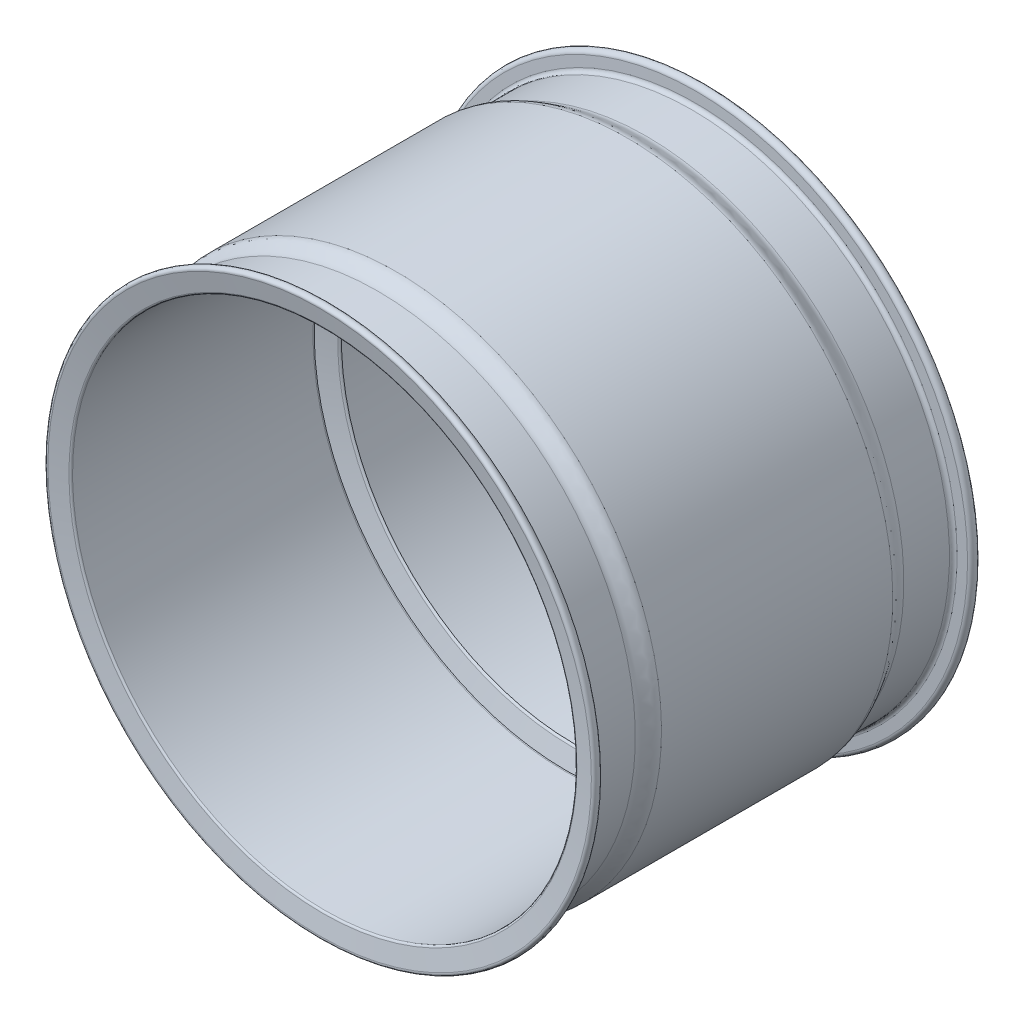
ISO-10303-21;
HEADER;
FILE_DESCRIPTION(('STEP AP214'),'2;1');
FILE_NAME('part.step','',(''),(''),'','','');
FILE_SCHEMA(('AUTOMOTIVE_DESIGN { 1 0 10303 214 1 1 1 1 }'));
ENDSEC;
DATA;
#1=APPLICATION_CONTEXT('core data for automotive mechanical design processes');
#2=APPLICATION_PROTOCOL_DEFINITION('international standard','automotive_design',2000,#1);
#3=PRODUCT_CONTEXT('',#1,'mechanical');
#4=PRODUCT('Part','Part','',(#3));
#5=PRODUCT_RELATED_PRODUCT_CATEGORY('part','',(#4));
#6=PRODUCT_DEFINITION_FORMATION('','',#4);
#7=PRODUCT_DEFINITION_CONTEXT('part definition',#1,'design');
#8=PRODUCT_DEFINITION('design','',#6,#7);
#9=PRODUCT_DEFINITION_SHAPE('','',#8);
#10=(LENGTH_UNIT() NAMED_UNIT(*) SI_UNIT(.MILLI.,.METRE.));
#11=(NAMED_UNIT(*) PLANE_ANGLE_UNIT() SI_UNIT($,.RADIAN.));
#12=(NAMED_UNIT(*) SI_UNIT($,.STERADIAN.) SOLID_ANGLE_UNIT());
#13=UNCERTAINTY_MEASURE_WITH_UNIT(LENGTH_MEASURE(1.E-05),#10,'distance_accuracy_value','');
#14=(GEOMETRIC_REPRESENTATION_CONTEXT(3) GLOBAL_UNCERTAINTY_ASSIGNED_CONTEXT((#13)) GLOBAL_UNIT_ASSIGNED_CONTEXT((#10,
#11,#12)) REPRESENTATION_CONTEXT('',''));
#15=CARTESIAN_POINT('',(0.,0.,0.));
#16=DIRECTION('',(0.,0.,1.));
#17=DIRECTION('',(1.,0.,0.));
#18=AXIS2_PLACEMENT_3D('',#15,#16,#17);
#19=CARTESIAN_POINT('',(2179.59090909091,2825.,1112.32747936763));
#20=DIRECTION('',(0.,0.,-1.));
#21=DIRECTION('',(0.,-1.,0.));
#22=AXIS2_PLACEMENT_3D('',#19,#20,#21);
#23=CYLINDRICAL_SURFACE('',#22,721.179115055064);
#24=CARTESIAN_POINT('',(2179.59090909091,2825.,456.051904093198));
#25=DIRECTION('',(0.,0.,1.));
#26=DIRECTION('',(0.,-1.,0.));
#27=AXIS2_PLACEMENT_3D('',#24,#25,#26);
#28=CIRCLE('',#27,721.179115055066);
#29=CARTESIAN_POINT('',(2179.59090909091,2103.82088494493,456.051904093198));
#30=VERTEX_POINT('',#29);
#31=EDGE_CURVE('E10',#30,#30,#28,.T.);
#32=ORIENTED_EDGE('',*,*,#31,.F.);
#33=EDGE_LOOP('',(#32));
#34=FACE_BOUND('',#33,.T.);
#35=CARTESIAN_POINT('',(2179.59090909091,2825.,1143.38509663262));
#36=DIRECTION('',(0.,0.,1.));
#37=DIRECTION('',(0.,-1.,0.));
#38=AXIS2_PLACEMENT_3D('',#35,#36,#37);
#39=CIRCLE('',#38,721.179115055062);
#40=CARTESIAN_POINT('',(2179.59090909091,2103.82088494494,1143.38509663262));
#41=VERTEX_POINT('',#40);
#42=EDGE_CURVE('E217',#41,#41,#39,.T.);
#43=ORIENTED_EDGE('',*,*,#42,.T.);
#44=EDGE_LOOP('',(#43));
#45=FACE_BOUND('',#44,.T.);
#46=ADVANCED_FACE('F15',(#34,#45),#23,.F.);
#47=CARTESIAN_POINT('',(2179.59090909091,2825.,456.051904093198));
#48=DIRECTION('',(0.,0.,1.));
#49=DIRECTION('',(0.,1.,0.));
#50=AXIS2_PLACEMENT_3D('',#47,#48,#49);
#51=CONICAL_SURFACE('',#50,721.179115055066,0.0244340149573436);
#52=CARTESIAN_POINT('',(2179.59090909091,2825.,452.4598462684));
#53=DIRECTION('',(0.,0.,1.));
#54=DIRECTION('',(0.,-1.,0.));
#55=AXIS2_PLACEMENT_3D('',#52,#53,#54);
#56=CIRCLE('',#55,721.091329189748);
#57=CARTESIAN_POINT('',(2179.59090909091,2103.90867081025,452.4598462684));
#58=VERTEX_POINT('',#57);
#59=EDGE_CURVE('E21',#58,#58,#56,.T.);
#60=ORIENTED_EDGE('',*,*,#59,.F.);
#61=EDGE_LOOP('',(#60));
#62=FACE_BOUND('',#61,.T.);
#63=ORIENTED_EDGE('',*,*,#31,.T.);
#64=EDGE_LOOP('',(#63));
#65=FACE_BOUND('',#64,.T.);
#66=ADVANCED_FACE('F208',(#62,#65),#51,.F.);
#67=CARTESIAN_POINT('',(2179.59090909091,2825.,436.990358136073));
#68=DIRECTION('',(0.,0.,1.));
#69=DIRECTION('',(0.,1.,0.));
#70=AXIS2_PLACEMENT_3D('',#67,#68,#69);
#71=CONICAL_SURFACE('',#70,669.40637050296,1.27997866155326);
#72=ORIENTED_EDGE('',*,*,#59,.T.);
#73=EDGE_LOOP('',(#72));
#74=FACE_BOUND('',#73,.T.);
#75=CARTESIAN_POINT('',(2179.59090909091,2825.,436.990358136073));
#76=DIRECTION('',(0.,0.,1.));
#77=DIRECTION('',(0.,-1.,0.));
#78=AXIS2_PLACEMENT_3D('',#75,#76,#77);
#79=CIRCLE('',#78,669.40637050296);
#80=CARTESIAN_POINT('',(2179.59090909091,2155.59362949704,436.990358136073));
#81=VERTEX_POINT('',#80);
#82=EDGE_CURVE('E25',#81,#81,#79,.T.);
#83=ORIENTED_EDGE('',*,*,#82,.F.);
#84=EDGE_LOOP('',(#83));
#85=FACE_BOUND('',#84,.T.);
#86=ADVANCED_FACE('F139',(#74,#85),#71,.F.);
#87=CARTESIAN_POINT('',(2179.59090909091,3494.40637050296,436.990358136073));
#88=CARTESIAN_POINT('',(2179.59090909091,3491.36723955013,436.080735657856));
#89=CARTESIAN_POINT('',(2179.59090909091,3487.63100382925,431.202498275328));
#90=CARTESIAN_POINT('',(2179.59090909091,3490.44745653853,430.524126870084));
#91=B_SPLINE_CURVE_WITH_KNOTS('',3,(#87,#88,#89,#90),.UNSPECIFIED.,.F.,.F.,(4,4),(0.,1.),.UNSPECIFIED.);
#92=CARTESIAN_POINT('',(2179.59090909091,2825.,1112.32747936763));
#93=DIRECTION('',(0.,0.,-1.));
#94=AXIS1_PLACEMENT('',#92,#93);
#95=SURFACE_OF_REVOLUTION('',#91,#94);
#96=CARTESIAN_POINT('',(2179.59090909091,2825.,430.524126870084));
#97=DIRECTION('',(0.,0.,1.));
#98=DIRECTION('',(0.,-1.,0.));
#99=AXIS2_PLACEMENT_3D('',#96,#97,#98);
#100=CIRCLE('',#99,665.447456538525);
#101=CARTESIAN_POINT('',(2179.59090909091,2159.55254346148,430.524126870084));
#102=VERTEX_POINT('',#101);
#103=EDGE_CURVE('E29',#102,#102,#100,.T.);
#104=ORIENTED_EDGE('',*,*,#103,.F.);
#105=EDGE_LOOP('',(#104));
#106=FACE_BOUND('',#105,.T.);
#107=ORIENTED_EDGE('',*,*,#82,.T.);
#108=EDGE_LOOP('',(#107));
#109=FACE_BOUND('',#108,.T.);
#110=ADVANCED_FACE('F135',(#106,#109),#95,.F.);
#111=CARTESIAN_POINT('',(2179.59090909091,2825.,420.790098404032));
#112=DIRECTION('',(0.,0.,-1.));
#113=DIRECTION('',(0.,-1.,0.));
#114=AXIS2_PLACEMENT_3D('',#111,#112,#113);
#115=CONICAL_SURFACE('',#114,705.861056866308,1.33443813978017);
#116=ORIENTED_EDGE('',*,*,#103,.T.);
#117=EDGE_LOOP('',(#116));
#118=FACE_BOUND('',#117,.T.);
#119=CARTESIAN_POINT('',(2179.59090909091,2825.,420.790098404032));
#120=DIRECTION('',(0.,0.,1.));
#121=DIRECTION('',(0.,-1.,0.));
#122=AXIS2_PLACEMENT_3D('',#119,#120,#121);
#123=CIRCLE('',#122,705.861056866308);
#124=CARTESIAN_POINT('',(2179.59090909091,2119.13894313369,420.790098404032));
#125=VERTEX_POINT('',#124);
#126=EDGE_CURVE('E34',#125,#125,#123,.T.);
#127=ORIENTED_EDGE('',*,*,#126,.F.);
#128=EDGE_LOOP('',(#127));
#129=FACE_BOUND('',#128,.T.);
#130=ADVANCED_FACE('F131',(#118,#129),#115,.F.);
#131=CARTESIAN_POINT('',(2179.59090909091,3530.86105686631,420.790098404032));
#132=CARTESIAN_POINT('',(2179.59090909091,3539.13783855351,418.796550986907));
#133=CARTESIAN_POINT('',(2179.59090909091,3546.17911505506,413.046835494573));
#134=CARTESIAN_POINT('',(2179.59090909091,3546.17911505506,405.146124083604));
#135=B_SPLINE_CURVE_WITH_KNOTS('',3,(#131,#132,#133,#134),.UNSPECIFIED.,.F.,.F.,(4,4),(0.,1.),.UNSPECIFIED.);
#136=CARTESIAN_POINT('',(2179.59090909091,2825.,1112.32747936763));
#137=DIRECTION('',(0.,0.,-1.));
#138=AXIS1_PLACEMENT('',#136,#137);
#139=SURFACE_OF_REVOLUTION('',#135,#138);
#140=CARTESIAN_POINT('',(2179.59090909091,2825.,405.146124083604));
#141=DIRECTION('',(0.,0.,1.));
#142=DIRECTION('',(0.,-1.,0.));
#143=AXIS2_PLACEMENT_3D('',#140,#141,#142);
#144=CIRCLE('',#143,721.179115055064);
#145=CARTESIAN_POINT('',(2179.59090909091,2103.82088494494,405.146124083604));
#146=VERTEX_POINT('',#145);
#147=EDGE_CURVE('E37',#146,#146,#144,.T.);
#148=ORIENTED_EDGE('',*,*,#147,.F.);
#149=EDGE_LOOP('',(#148));
#150=FACE_BOUND('',#149,.T.);
#151=ORIENTED_EDGE('',*,*,#126,.T.);
#152=EDGE_LOOP('',(#151));
#153=FACE_BOUND('',#152,.T.);
#154=ADVANCED_FACE('F127',(#150,#153),#139,.F.);
#155=CARTESIAN_POINT('',(2179.59090909091,2825.,1112.32747936763));
#156=DIRECTION('',(0.,0.,-1.));
#157=DIRECTION('',(0.,-1.,0.));
#158=AXIS2_PLACEMENT_3D('',#155,#156,#157);
#159=CYLINDRICAL_SURFACE('',#158,721.179115055062);
#160=CARTESIAN_POINT('',(2179.59090909091,2825.,72.9845254667847));
#161=DIRECTION('',(0.,0.,1.));
#162=DIRECTION('',(0.,-1.,0.));
#163=AXIS2_PLACEMENT_3D('',#160,#161,#162);
#164=CIRCLE('',#163,721.179115055061);
#165=CARTESIAN_POINT('',(2179.59090909091,2103.82088494494,72.9845254667847));
#166=VERTEX_POINT('',#165);
#167=EDGE_CURVE('E40',#166,#166,#164,.T.);
#168=ORIENTED_EDGE('',*,*,#167,.F.);
#169=EDGE_LOOP('',(#168));
#170=FACE_BOUND('',#169,.T.);
#171=ORIENTED_EDGE('',*,*,#147,.T.);
#172=EDGE_LOOP('',(#171));
#173=FACE_BOUND('',#172,.T.);
#174=ADVANCED_FACE('F123',(#170,#173),#159,.F.);
#175=CARTESIAN_POINT('',(2179.59090909091,3551.16618202824,67.652859038172));
#176=CARTESIAN_POINT('',(2179.59090909091,3548.4011526096,68.168997862986));
#177=CARTESIAN_POINT('',(2179.59090909091,3546.17911505506,70.2889027513693));
#178=CARTESIAN_POINT('',(2179.59090909091,3546.17911505506,72.9845254667847));
#179=B_SPLINE_CURVE_WITH_KNOTS('',3,(#175,#176,#177,#178),.UNSPECIFIED.,.F.,.F.,(4,4),(0.,1.),.UNSPECIFIED.);
#180=CARTESIAN_POINT('',(2179.59090909091,2825.,1112.32747936763));
#181=DIRECTION('',(0.,0.,-1.));
#182=AXIS1_PLACEMENT('',#180,#181);
#183=SURFACE_OF_REVOLUTION('',#179,#182);
#184=ORIENTED_EDGE('',*,*,#167,.T.);
#185=EDGE_LOOP('',(#184));
#186=FACE_BOUND('',#185,.T.);
#187=CARTESIAN_POINT('',(2179.59090909091,2825.,67.652859038172));
#188=DIRECTION('',(0.,0.,1.));
#189=DIRECTION('',(0.,-1.,0.));
#190=AXIS2_PLACEMENT_3D('',#187,#188,#189);
#191=CIRCLE('',#190,726.166182028236);
#192=CARTESIAN_POINT('',(2179.59090909091,2098.83381797176,67.652859038172));
#193=VERTEX_POINT('',#192);
#194=EDGE_CURVE('E43',#193,#193,#191,.T.);
#195=ORIENTED_EDGE('',*,*,#194,.F.);
#196=EDGE_LOOP('',(#195));
#197=FACE_BOUND('',#196,.T.);
#198=ADVANCED_FACE('F120',(#186,#197),#183,.T.);
#199=CARTESIAN_POINT('',(2179.59090909091,2825.,67.652859038172));
#200=DIRECTION('',(0.,0.,-1.));
#201=DIRECTION('',(0.,-1.,0.));
#202=AXIS2_PLACEMENT_3D('',#199,#200,#201);
#203=CONICAL_SURFACE('',#202,726.166182028236,1.38625352960428);
#204=CARTESIAN_POINT('',(2179.59090909091,2825.,58.1848110498031));
#205=DIRECTION('',(0.,0.,1.));
#206=DIRECTION('',(0.,-1.,0.));
#207=AXIS2_PLACEMENT_3D('',#204,#205,#206);
#208=CIRCLE('',#207,776.887867680218);
#209=CARTESIAN_POINT('',(2179.59090909091,2048.11213231978,58.1848110498031));
#210=VERTEX_POINT('',#209);
#211=EDGE_CURVE('E46',#210,#210,#208,.T.);
#212=ORIENTED_EDGE('',*,*,#211,.F.);
#213=EDGE_LOOP('',(#212));
#214=FACE_BOUND('',#213,.T.);
#215=ORIENTED_EDGE('',*,*,#194,.T.);
#216=EDGE_LOOP('',(#215));
#217=FACE_BOUND('',#216,.T.);
#218=ADVANCED_FACE('F99',(#214,#217),#203,.F.);
#219=CARTESIAN_POINT('',(2179.59090909091,3600.79676583452,81.5666303381679));
#220=CARTESIAN_POINT('',(2179.59090909091,3615.62388812196,80.8135066664271));
#221=CARTESIAN_POINT('',(2179.59090909091,3615.86845431008,55.5751015455659));
#222=CARTESIAN_POINT('',(2179.59090909091,3601.88786768022,58.1848110498031));
#223=B_SPLINE_CURVE_WITH_KNOTS('',3,(#219,#220,#221,#222),.UNSPECIFIED.,.F.,.F.,(4,4),(0.,1.),.UNSPECIFIED.);
#224=CARTESIAN_POINT('',(2179.59090909091,2825.,1112.32747936763));
#225=DIRECTION('',(0.,0.,-1.));
#226=AXIS1_PLACEMENT('',#224,#225);
#227=SURFACE_OF_REVOLUTION('',#223,#226);
#228=ORIENTED_EDGE('',*,*,#211,.T.);
#229=EDGE_LOOP('',(#228));
#230=FACE_BOUND('',#229,.T.);
#231=CARTESIAN_POINT('',(2179.59090909091,2825.,81.5666303381679));
#232=DIRECTION('',(0.,0.,1.));
#233=DIRECTION('',(0.,-1.,0.));
#234=AXIS2_PLACEMENT_3D('',#231,#232,#233);
#235=CIRCLE('',#234,775.796765834514);
#236=CARTESIAN_POINT('',(2179.59090909091,2049.20323416549,81.5666303381679));
#237=VERTEX_POINT('',#236);
#238=EDGE_CURVE('E49',#237,#237,#235,.T.);
#239=ORIENTED_EDGE('',*,*,#238,.F.);
#240=EDGE_LOOP('',(#239));
#241=FACE_BOUND('',#240,.T.);
#242=ADVANCED_FACE('F95',(#230,#241),#227,.T.);
#243=CARTESIAN_POINT('',(2179.59090909091,2825.,81.5666303381679));
#244=DIRECTION('',(0.,0.,-1.));
#245=DIRECTION('',(0.,-1.,0.));
#246=AXIS2_PLACEMENT_3D('',#243,#244,#245);
#247=CONICAL_SURFACE('',#246,775.796765834514,1.52004629095966);
#248=CARTESIAN_POINT('',(2179.59090909091,2825.,83.0150235391436));
#249=DIRECTION('',(0.,0.,1.));
#250=DIRECTION('',(0.,-1.,0.));
#251=AXIS2_PLACEMENT_3D('',#248,#249,#250);
#252=CIRCLE('',#251,747.281524690308);
#253=CARTESIAN_POINT('',(2179.59090909091,2077.71847530969,83.0150235391436));
#254=VERTEX_POINT('',#253);
#255=EDGE_CURVE('E52',#254,#254,#252,.T.);
#256=ORIENTED_EDGE('',*,*,#255,.F.);
#257=EDGE_LOOP('',(#256));
#258=FACE_BOUND('',#257,.T.);
#259=ORIENTED_EDGE('',*,*,#238,.T.);
#260=EDGE_LOOP('',(#259));
#261=FACE_BOUND('',#260,.T.);
#262=ADVANCED_FACE('F91',(#258,#261),#247,.T.);
#263=CARTESIAN_POINT('',(2179.59090909091,3561.41857568299,93.9814292036729));
#264=CARTESIAN_POINT('',(2179.59090909091,3561.41857568299,88.0635030967296));
#265=CARTESIAN_POINT('',(2179.59090909091,3566.27297562468,83.3202196821636));
#266=CARTESIAN_POINT('',(2179.59090909091,3572.28152469031,83.0150235391436));
#267=B_SPLINE_CURVE_WITH_KNOTS('',3,(#263,#264,#265,#266),.UNSPECIFIED.,.F.,.F.,(4,4),(0.,1.),.UNSPECIFIED.);
#268=CARTESIAN_POINT('',(2179.59090909091,2825.,1112.32747936763));
#269=DIRECTION('',(0.,0.,-1.));
#270=AXIS1_PLACEMENT('',#268,#269);
#271=SURFACE_OF_REVOLUTION('',#267,#270);
#272=ORIENTED_EDGE('',*,*,#255,.T.);
#273=EDGE_LOOP('',(#272));
#274=FACE_BOUND('',#273,.T.);
#275=CARTESIAN_POINT('',(2179.59090909091,2825.,93.9814292036729));
#276=DIRECTION('',(0.,0.,1.));
#277=DIRECTION('',(0.,-1.,0.));
#278=AXIS2_PLACEMENT_3D('',#275,#276,#277);
#279=CIRCLE('',#278,736.41857568299);
#280=CARTESIAN_POINT('',(2179.59090909091,2088.58142431701,93.9814292036729));
#281=VERTEX_POINT('',#280);
#282=EDGE_CURVE('E55',#281,#281,#279,.T.);
#283=ORIENTED_EDGE('',*,*,#282,.F.);
#284=EDGE_LOOP('',(#283));
#285=FACE_BOUND('',#284,.T.);
#286=ADVANCED_FACE('F87',(#274,#285),#271,.T.);
#287=CARTESIAN_POINT('',(2179.59090909091,2825.,1112.32747936763));
#288=DIRECTION('',(0.,0.,-1.));
#289=DIRECTION('',(0.,-1.,0.));
#290=AXIS2_PLACEMENT_3D('',#287,#288,#289);
#291=CYLINDRICAL_SURFACE('',#290,736.41857568299);
#292=CARTESIAN_POINT('',(2179.59090909091,2825.,224.378087188264));
#293=DIRECTION('',(0.,0.,1.));
#294=DIRECTION('',(0.,-1.,0.));
#295=AXIS2_PLACEMENT_3D('',#292,#293,#294);
#296=CIRCLE('',#295,736.418575682989);
#297=CARTESIAN_POINT('',(2179.59090909091,2088.58142431701,224.378087188264));
#298=VERTEX_POINT('',#297);
#299=EDGE_CURVE('E58',#298,#298,#296,.T.);
#300=ORIENTED_EDGE('',*,*,#299,.F.);
#301=EDGE_LOOP('',(#300));
#302=FACE_BOUND('',#301,.T.);
#303=ORIENTED_EDGE('',*,*,#282,.T.);
#304=EDGE_LOOP('',(#303));
#305=FACE_BOUND('',#304,.T.);
#306=ADVANCED_FACE('F82',(#302,#305),#291,.T.);
#307=CARTESIAN_POINT('',(2179.59090909091,3582.99616821241,277.574877271181));
#308=CARTESIAN_POINT('',(2179.59090909091,3582.99616821241,257.711122559907));
#309=CARTESIAN_POINT('',(2179.59090909091,3561.41857568299,244.241841899539));
#310=CARTESIAN_POINT('',(2179.59090909091,3561.41857568299,224.378087188264));
#311=B_SPLINE_CURVE_WITH_KNOTS('',3,(#307,#308,#309,#310),.UNSPECIFIED.,.F.,.F.,(4,4),(0.,1.),.UNSPECIFIED.);
#312=CARTESIAN_POINT('',(2179.59090909091,2825.,1112.32747936763));
#313=DIRECTION('',(0.,0.,-1.));
#314=AXIS1_PLACEMENT('',#312,#313);
#315=SURFACE_OF_REVOLUTION('',#311,#314);
#316=ORIENTED_EDGE('',*,*,#299,.T.);
#317=EDGE_LOOP('',(#316));
#318=FACE_BOUND('',#317,.T.);
#319=CARTESIAN_POINT('',(2179.59090909091,2825.,277.574877271181));
#320=DIRECTION('',(0.,0.,1.));
#321=DIRECTION('',(0.,-1.,0.));
#322=AXIS2_PLACEMENT_3D('',#319,#320,#321);
#323=CIRCLE('',#322,757.996168212409);
#324=CARTESIAN_POINT('',(2179.59090909091,2067.00383178759,277.574877271181));
#325=VERTEX_POINT('',#324);
#326=EDGE_CURVE('E61',#325,#325,#323,.T.);
#327=ORIENTED_EDGE('',*,*,#326,.F.);
#328=EDGE_LOOP('',(#327));
#329=FACE_BOUND('',#328,.T.);
#330=ADVANCED_FACE('F77',(#318,#329),#315,.T.);
#331=CARTESIAN_POINT('',(2179.59090909091,2825.,1112.32747936763));
#332=DIRECTION('',(0.,0.,-1.));
#333=DIRECTION('',(0.,-1.,0.));
#334=AXIS2_PLACEMENT_3D('',#331,#332,#333);
#335=CYLINDRICAL_SURFACE('',#334,757.99616821241);
#336=ORIENTED_EDGE('',*,*,#326,.T.);
#337=EDGE_LOOP('',(#336));
#338=FACE_BOUND('',#337,.T.);
#339=CARTESIAN_POINT('',(2179.59090909091,2825.,938.794744828221));
#340=DIRECTION('',(0.,0.,1.));
#341=DIRECTION('',(0.,-1.,0.));
#342=AXIS2_PLACEMENT_3D('',#339,#340,#341);
#343=CIRCLE('',#342,757.99616821241);
#344=CARTESIAN_POINT('',(2179.59090909091,2067.00383178759,938.794744828221));
#345=VERTEX_POINT('',#344);
#346=EDGE_CURVE('E64',#345,#345,#343,.T.);
#347=ORIENTED_EDGE('',*,*,#346,.F.);
#348=EDGE_LOOP('',(#347));
#349=FACE_BOUND('',#348,.T.);
#350=ADVANCED_FACE('F81',(#338,#349),#335,.T.);
#351=CARTESIAN_POINT('',(2179.59090909091,3600.79676583452,1134.80299176123));
#352=CARTESIAN_POINT('',(2179.59090909091,3615.62388812196,1135.55611543297));
#353=CARTESIAN_POINT('',(2179.59090909091,3615.86845431008,1160.79452055384));
#354=CARTESIAN_POINT('',(2179.59090909091,3601.88786768023,1158.1848110496));
#355=B_SPLINE_CURVE_WITH_KNOTS('',3,(#351,#352,#353,#354),.UNSPECIFIED.,.F.,.F.,(4,4),(0.,1.),.UNSPECIFIED.);
#356=CARTESIAN_POINT('',(2179.59090909091,2825.,1416.59329328063));
#357=DIRECTION('',(0.,0.,-1.));
#358=AXIS1_PLACEMENT('',#356,#357);
#359=SURFACE_OF_REVOLUTION('',#355,#358);
#360=CARTESIAN_POINT('',(2179.59090909091,2825.,1158.1848110496));
#361=DIRECTION('',(0.,0.,1.));
#362=DIRECTION('',(0.,-1.,0.));
#363=AXIS2_PLACEMENT_3D('',#360,#361,#362);
#364=CIRCLE('',#363,776.88786768022);
#365=CARTESIAN_POINT('',(2179.59090909091,2048.11213231978,1158.1848110496));
#366=VERTEX_POINT('',#365);
#367=EDGE_CURVE('E223',#366,#366,#364,.T.);
#368=ORIENTED_EDGE('',*,*,#367,.F.);
#369=EDGE_LOOP('',(#368));
#370=FACE_BOUND('',#369,.T.);
#371=CARTESIAN_POINT('',(2179.59090909091,2825.,1134.80299176123));
#372=DIRECTION('',(0.,0.,1.));
#373=DIRECTION('',(0.,-1.,0.));
#374=AXIS2_PLACEMENT_3D('',#371,#372,#373);
#375=CIRCLE('',#374,775.796765834517);
#376=CARTESIAN_POINT('',(2179.59090909091,2049.20323416548,1134.80299176123));
#377=VERTEX_POINT('',#376);
#378=EDGE_CURVE('E190',#377,#377,#375,.T.);
#379=ORIENTED_EDGE('',*,*,#378,.T.);
#380=EDGE_LOOP('',(#379));
#381=FACE_BOUND('',#380,.T.);
#382=ADVANCED_FACE('F195',(#370,#381),#359,.F.);
#383=CARTESIAN_POINT('',(2179.59090909091,2825.,1148.71676306123));
#384=DIRECTION('',(0.,0.,1.));
#385=DIRECTION('',(0.,1.,0.));
#386=AXIS2_PLACEMENT_3D('',#383,#384,#385);
#387=CONICAL_SURFACE('',#386,726.166182028237,1.38625352960428);
#388=ORIENTED_EDGE('',*,*,#367,.T.);
#389=EDGE_LOOP('',(#388));
#390=FACE_BOUND('',#389,.T.);
#391=CARTESIAN_POINT('',(2179.59090909091,2825.,1148.71676306123));
#392=DIRECTION('',(0.,0.,1.));
#393=DIRECTION('',(0.,-1.,0.));
#394=AXIS2_PLACEMENT_3D('',#391,#392,#393);
#395=CIRCLE('',#394,726.166182028237);
#396=CARTESIAN_POINT('',(2179.59090909091,2098.83381797176,1148.71676306123));
#397=VERTEX_POINT('',#396);
#398=EDGE_CURVE('E218',#397,#397,#395,.T.);
#399=ORIENTED_EDGE('',*,*,#398,.F.);
#400=EDGE_LOOP('',(#399));
#401=FACE_BOUND('',#400,.T.);
#402=ADVANCED_FACE('F165',(#390,#401),#387,.F.);
#403=CARTESIAN_POINT('',(2179.59090909091,3551.16618202824,1148.71676306123));
#404=CARTESIAN_POINT('',(2179.59090909091,3548.4011526096,1148.20062423642));
#405=CARTESIAN_POINT('',(2179.59090909091,3546.17911505506,1146.08071934802));
#406=CARTESIAN_POINT('',(2179.59090909091,3546.17911505506,1143.38509663262));
#407=B_SPLINE_CURVE_WITH_KNOTS('',3,(#403,#404,#405,#406),.UNSPECIFIED.,.F.,.F.,(4,4),(0.,1.),.UNSPECIFIED.);
#408=CARTESIAN_POINT('',(2179.59090909091,2825.,1416.59329328063));
#409=DIRECTION('',(0.,0.,-1.));
#410=AXIS1_PLACEMENT('',#408,#409);
#411=SURFACE_OF_REVOLUTION('',#407,#410);
#412=ORIENTED_EDGE('',*,*,#42,.F.);
#413=EDGE_LOOP('',(#412));
#414=FACE_BOUND('',#413,.T.);
#415=ORIENTED_EDGE('',*,*,#398,.T.);
#416=EDGE_LOOP('',(#415));
#417=FACE_BOUND('',#416,.T.);
#418=ADVANCED_FACE('F160',(#414,#417),#411,.F.);
#419=CARTESIAN_POINT('',(2179.59090909091,2825.,1134.80299176123));
#420=DIRECTION('',(0.,0.,1.));
#421=DIRECTION('',(0.,1.,0.));
#422=AXIS2_PLACEMENT_3D('',#419,#420,#421);
#423=CONICAL_SURFACE('',#422,775.796765834517,1.52004629095967);
#424=CARTESIAN_POINT('',(2179.59090909091,2825.,1133.35459856026));
#425=DIRECTION('',(0.,0.,1.));
#426=DIRECTION('',(0.,-1.,0.));
#427=AXIS2_PLACEMENT_3D('',#424,#425,#426);
#428=CIRCLE('',#427,747.281524690309);
#429=CARTESIAN_POINT('',(2179.59090909091,2077.71847530969,1133.35459856026));
#430=VERTEX_POINT('',#429);
#431=EDGE_CURVE('E221',#430,#430,#428,.T.);
#432=ORIENTED_EDGE('',*,*,#431,.T.);
#433=EDGE_LOOP('',(#432));
#434=FACE_BOUND('',#433,.T.);
#435=ORIENTED_EDGE('',*,*,#378,.F.);
#436=EDGE_LOOP('',(#435));
#437=FACE_BOUND('',#436,.T.);
#438=ADVANCED_FACE('F164',(#434,#437),#423,.T.);
#439=CARTESIAN_POINT('',(2179.59090909091,3561.41857568299,1122.38819289572));
#440=CARTESIAN_POINT('',(2179.59090909091,3561.41857568299,1128.30611900267));
#441=CARTESIAN_POINT('',(2179.59090909091,3566.27297562468,1133.04940241724));
#442=CARTESIAN_POINT('',(2179.59090909091,3572.28152469031,1133.35459856026));
#443=B_SPLINE_CURVE_WITH_KNOTS('',3,(#439,#440,#441,#442),.UNSPECIFIED.,.F.,.F.,(4,4),(0.,1.),.UNSPECIFIED.);
#444=CARTESIAN_POINT('',(2179.59090909091,2825.,1416.59329328063));
#445=DIRECTION('',(0.,0.,-1.));
#446=AXIS1_PLACEMENT('',#444,#445);
#447=SURFACE_OF_REVOLUTION('',#443,#446);
#448=ORIENTED_EDGE('',*,*,#431,.F.);
#449=EDGE_LOOP('',(#448));
#450=FACE_BOUND('',#449,.T.);
#451=CARTESIAN_POINT('',(2179.59090909091,2825.,1122.38819289572));
#452=DIRECTION('',(0.,0.,1.));
#453=DIRECTION('',(0.,-1.,0.));
#454=AXIS2_PLACEMENT_3D('',#451,#452,#453);
#455=CIRCLE('',#454,736.418575682992);
#456=CARTESIAN_POINT('',(2179.59090909091,2088.58142431701,1122.38819289572));
#457=VERTEX_POINT('',#456);
#458=EDGE_CURVE('E232',#457,#457,#455,.T.);
#459=ORIENTED_EDGE('',*,*,#458,.T.);
#460=EDGE_LOOP('',(#459));
#461=FACE_BOUND('',#460,.T.);
#462=ADVANCED_FACE('F175',(#450,#461),#447,.F.);
#463=CARTESIAN_POINT('',(2179.59090909091,2825.,1416.59329328063));
#464=DIRECTION('',(0.,0.,-1.));
#465=DIRECTION('',(0.,-1.,0.));
#466=AXIS2_PLACEMENT_3D('',#463,#464,#465);
#467=CYLINDRICAL_SURFACE('',#466,736.418575682991);
#468=CARTESIAN_POINT('',(2179.59090909091,2825.,991.991534911135));
#469=DIRECTION('',(0.,0.,1.));
#470=DIRECTION('',(0.,-1.,0.));
#471=AXIS2_PLACEMENT_3D('',#468,#469,#470);
#472=CIRCLE('',#471,736.41857568299);
#473=CARTESIAN_POINT('',(2179.59090909091,2088.58142431701,991.991534911135));
#474=VERTEX_POINT('',#473);
#475=EDGE_CURVE('E229',#474,#474,#472,.T.);
#476=ORIENTED_EDGE('',*,*,#475,.T.);
#477=EDGE_LOOP('',(#476));
#478=FACE_BOUND('',#477,.T.);
#479=ORIENTED_EDGE('',*,*,#458,.F.);
#480=EDGE_LOOP('',(#479));
#481=FACE_BOUND('',#480,.T.);
#482=ADVANCED_FACE('F171',(#478,#481),#467,.T.);
#483=CARTESIAN_POINT('',(2179.59090909091,3582.99616821242,938.794744828221));
#484=CARTESIAN_POINT('',(2179.59090909091,3582.99616821241,958.658499539494));
#485=CARTESIAN_POINT('',(2179.59090909091,3561.41857568299,972.127780199862));
#486=CARTESIAN_POINT('',(2179.59090909091,3561.41857568299,991.991534911135));
#487=B_SPLINE_CURVE_WITH_KNOTS('',3,(#483,#484,#485,#486),.UNSPECIFIED.,.F.,.F.,(4,4),(0.,1.),.UNSPECIFIED.);
#488=CARTESIAN_POINT('',(2179.59090909091,2825.,1416.59329328063));
#489=DIRECTION('',(0.,0.,-1.));
#490=AXIS1_PLACEMENT('',#488,#489);
#491=SURFACE_OF_REVOLUTION('',#487,#490);
#492=ORIENTED_EDGE('',*,*,#475,.F.);
#493=EDGE_LOOP('',(#492));
#494=FACE_BOUND('',#493,.T.);
#495=ORIENTED_EDGE('',*,*,#346,.T.);
#496=EDGE_LOOP('',(#495));
#497=FACE_BOUND('',#496,.T.);
#498=ADVANCED_FACE('F168',(#494,#497),#491,.F.);
#499=CLOSED_SHELL('',(#46,#66,#86,#110,#130,#154,#174,#198,#218,#242,#262,#286,#306,#330,#350,
#382,#402,#418,#438,#462,#482,#498));
#500=MANIFOLD_SOLID_BREP('B1',#499);
#501=ADVANCED_BREP_SHAPE_REPRESENTATION('',(#18,#500),#14);
#502=SHAPE_DEFINITION_REPRESENTATION(#9,#501);
ENDSEC;
END-ISO-10303-21;
